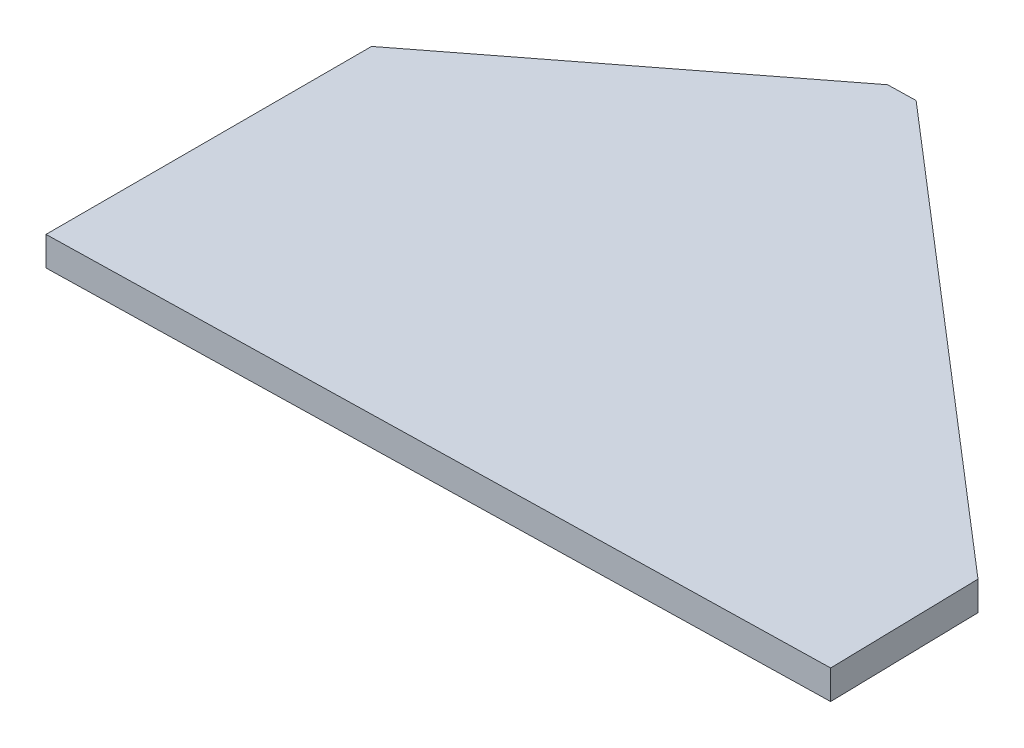
ISO-10303-21;
HEADER;
FILE_DESCRIPTION(('STEP AP214'),'2;1');
FILE_NAME('part.step','',(''),(''),'','','');
FILE_SCHEMA(('AUTOMOTIVE_DESIGN { 1 0 10303 214 1 1 1 1 }'));
ENDSEC;
DATA;
#1=APPLICATION_CONTEXT('core data for automotive mechanical design processes');
#2=APPLICATION_PROTOCOL_DEFINITION('international standard','automotive_design',2000,#1);
#3=PRODUCT_CONTEXT('',#1,'mechanical');
#4=PRODUCT('Part','Part','',(#3));
#5=PRODUCT_RELATED_PRODUCT_CATEGORY('part','',(#4));
#6=PRODUCT_DEFINITION_FORMATION('','',#4);
#7=PRODUCT_DEFINITION_CONTEXT('part definition',#1,'design');
#8=PRODUCT_DEFINITION('design','',#6,#7);
#9=PRODUCT_DEFINITION_SHAPE('','',#8);
#10=(LENGTH_UNIT() NAMED_UNIT(*) SI_UNIT(.MILLI.,.METRE.));
#11=(NAMED_UNIT(*) PLANE_ANGLE_UNIT() SI_UNIT($,.RADIAN.));
#12=(NAMED_UNIT(*) SI_UNIT($,.STERADIAN.) SOLID_ANGLE_UNIT());
#13=UNCERTAINTY_MEASURE_WITH_UNIT(LENGTH_MEASURE(1.E-05),#10,'distance_accuracy_value','');
#14=(GEOMETRIC_REPRESENTATION_CONTEXT(3) GLOBAL_UNCERTAINTY_ASSIGNED_CONTEXT((#13)) GLOBAL_UNIT_ASSIGNED_CONTEXT((#10,
#11,#12)) REPRESENTATION_CONTEXT('',''));
#15=CARTESIAN_POINT('',(0.,0.,0.));
#16=DIRECTION('',(0.,0.,1.));
#17=DIRECTION('',(1.,0.,0.));
#18=AXIS2_PLACEMENT_3D('',#15,#16,#17);
#19=CARTESIAN_POINT('',(19.9951946957844,2.,-37.7937154140761));
#20=DIRECTION('',(0.611139155400615,0.,0.791523172583231));
#21=DIRECTION('',(0.791523172583231,0.,-0.611139155400615));
#22=AXIS2_PLACEMENT_3D('',#19,#20,#21);
#23=PLANE('',#22);
#24=DIRECTION('',(-0.791523172583231,0.,0.611139155400615));
#25=VECTOR('',#24,1.);
#26=CARTESIAN_POINT('',(19.9951946957844,0.,-37.7937154140761));
#27=LINE('',#26,#25);
#28=CARTESIAN_POINT('',(19.9951946957844,0.,-37.7937154140761));
#29=VERTEX_POINT('',#28);
#30=CARTESIAN_POINT('',(0.,0.,-22.3553216667754));
#31=VERTEX_POINT('',#30);
#32=EDGE_CURVE('E128',#29,#31,#27,.T.);
#33=ORIENTED_EDGE('',*,*,#32,.T.);
#34=DIRECTION('',(0.,-1.,0.));
#35=VECTOR('',#34,1.);
#36=CARTESIAN_POINT('',(0.,2.,-22.3553216667754));
#37=LINE('',#36,#35);
#38=CARTESIAN_POINT('',(0.,2.,-22.3553216667754));
#39=VERTEX_POINT('',#38);
#40=EDGE_CURVE('E11',#39,#31,#37,.T.);
#41=ORIENTED_EDGE('',*,*,#40,.F.);
#42=DIRECTION('',(-0.791523172583231,0.,0.611139155400615));
#43=VECTOR('',#42,1.);
#44=CARTESIAN_POINT('',(19.9951946957844,2.,-37.7937154140761));
#45=LINE('',#44,#43);
#46=CARTESIAN_POINT('',(19.9951946957844,2.,-37.7937154140761));
#47=VERTEX_POINT('',#46);
#48=EDGE_CURVE('E144',#47,#39,#45,.T.);
#49=ORIENTED_EDGE('',*,*,#48,.F.);
#50=DIRECTION('',(0.,-1.,0.));
#51=VECTOR('',#50,1.);
#52=CARTESIAN_POINT('',(19.9951946957844,2.,-37.7937154140761));
#53=LINE('',#52,#51);
#54=EDGE_CURVE('E124',#47,#29,#53,.T.);
#55=ORIENTED_EDGE('',*,*,#54,.T.);
#56=EDGE_LOOP('',(#33,#41,#49,#55));
#57=FACE_BOUND('',#56,.T.);
#58=ADVANCED_FACE('F39',(#57),#23,.F.);
#59=CARTESIAN_POINT('',(0.,2.,-22.3553216667754));
#60=DIRECTION('',(1.,0.,0.));
#61=DIRECTION('',(0.,0.,-1.));
#62=AXIS2_PLACEMENT_3D('',#59,#60,#61);
#63=PLANE('',#62);
#64=DIRECTION('',(0.,0.,1.));
#65=VECTOR('',#64,1.);
#66=CARTESIAN_POINT('',(0.,0.,-22.3553216667754));
#67=LINE('',#66,#65);
#68=CARTESIAN_POINT('',(0.,0.,0.));
#69=VERTEX_POINT('',#68);
#70=EDGE_CURVE('E132',#31,#69,#67,.T.);
#71=ORIENTED_EDGE('',*,*,#70,.T.);
#72=DIRECTION('',(0.,-1.,0.));
#73=VECTOR('',#72,1.);
#74=CARTESIAN_POINT('',(0.,2.,0.));
#75=LINE('',#74,#73);
#76=CARTESIAN_POINT('',(0.,2.,0.));
#77=VERTEX_POINT('',#76);
#78=EDGE_CURVE('E48',#77,#69,#75,.T.);
#79=ORIENTED_EDGE('',*,*,#78,.F.);
#80=DIRECTION('',(0.,0.,1.));
#81=VECTOR('',#80,1.);
#82=CARTESIAN_POINT('',(0.,2.,-22.3553216667754));
#83=LINE('',#82,#81);
#84=EDGE_CURVE('E93',#39,#77,#83,.T.);
#85=ORIENTED_EDGE('',*,*,#84,.F.);
#86=ORIENTED_EDGE('',*,*,#40,.T.);
#87=EDGE_LOOP('',(#71,#79,#85,#86));
#88=FACE_BOUND('',#87,.T.);
#89=ADVANCED_FACE('F172',(#88),#63,.F.);
#90=CARTESIAN_POINT('',(0.,2.,0.));
#91=DIRECTION('',(-0.0219196873650202,0.,-0.999759734789224));
#92=DIRECTION('',(-0.999759734789224,0.,0.0219196873650202));
#93=AXIS2_PLACEMENT_3D('',#90,#91,#92);
#94=PLANE('',#93);
#95=DIRECTION('',(0.999759734789224,0.,-0.0219196873650202));
#96=VECTOR('',#95,1.);
#97=CARTESIAN_POINT('',(0.,0.,0.));
#98=LINE('',#97,#96);
#99=CARTESIAN_POINT('',(52.7262708985373,0.,-1.15602112567872));
#100=VERTEX_POINT('',#99);
#101=EDGE_CURVE('E135',#69,#100,#98,.T.);
#102=ORIENTED_EDGE('',*,*,#101,.T.);
#103=DIRECTION('',(0.,-1.,0.));
#104=VECTOR('',#103,1.);
#105=CARTESIAN_POINT('',(52.7262708985373,2.,-1.15602112567872));
#106=LINE('',#105,#104);
#107=CARTESIAN_POINT('',(52.7262708985373,2.,-1.15602112567872));
#108=VERTEX_POINT('',#107);
#109=EDGE_CURVE('E117',#108,#100,#106,.T.);
#110=ORIENTED_EDGE('',*,*,#109,.F.);
#111=DIRECTION('',(0.999759734789224,0.,-0.0219196873650202));
#112=VECTOR('',#111,1.);
#113=CARTESIAN_POINT('',(0.,2.,0.));
#114=LINE('',#113,#112);
#115=EDGE_CURVE('E106',#77,#108,#114,.T.);
#116=ORIENTED_EDGE('',*,*,#115,.F.);
#117=ORIENTED_EDGE('',*,*,#78,.T.);
#118=EDGE_LOOP('',(#102,#110,#116,#117));
#119=FACE_BOUND('',#118,.T.);
#120=ADVANCED_FACE('F154',(#119),#94,.F.);
#121=CARTESIAN_POINT('',(52.7262708985373,2.,-1.15602112567872));
#122=DIRECTION('',(-0.999759734789224,0.,0.0219196873650247));
#123=DIRECTION('',(0.0219196873650247,0.,0.999759734789224));
#124=AXIS2_PLACEMENT_3D('',#121,#122,#123);
#125=PLANE('',#124);
#126=DIRECTION('',(-0.0219196873650247,0.,-0.999759734789224));
#127=VECTOR('',#126,1.);
#128=CARTESIAN_POINT('',(52.7262708985373,0.,-1.15602112567872));
#129=LINE('',#128,#127);
#130=CARTESIAN_POINT('',(52.4994822182698,0.,-11.4998817411023));
#131=VERTEX_POINT('',#130);
#132=EDGE_CURVE('E115',#100,#131,#129,.T.);
#133=ORIENTED_EDGE('',*,*,#132,.T.);
#134=DIRECTION('',(0.,-1.,0.));
#135=VECTOR('',#134,1.);
#136=CARTESIAN_POINT('',(52.4994822182698,2.,-11.4998817411023));
#137=LINE('',#136,#135);
#138=CARTESIAN_POINT('',(52.4994822182698,2.,-11.4998817411023));
#139=VERTEX_POINT('',#138);
#140=EDGE_CURVE('E112',#139,#131,#137,.T.);
#141=ORIENTED_EDGE('',*,*,#140,.F.);
#142=DIRECTION('',(-0.0219196873650247,0.,-0.999759734789224));
#143=VECTOR('',#142,1.);
#144=CARTESIAN_POINT('',(52.7262708985373,2.,-1.15602112567872));
#145=LINE('',#144,#143);
#146=EDGE_CURVE('E100',#108,#139,#145,.T.);
#147=ORIENTED_EDGE('',*,*,#146,.F.);
#148=ORIENTED_EDGE('',*,*,#109,.T.);
#149=EDGE_LOOP('',(#133,#141,#147,#148));
#150=FACE_BOUND('',#149,.T.);
#151=ADVANCED_FACE('F113',(#150),#125,.F.);
#152=CARTESIAN_POINT('',(52.4994822182698,2.,-11.4998817411023));
#153=DIRECTION('',(-0.652511227364217,0.,0.757779056297839));
#154=DIRECTION('',(0.757779056297839,0.,0.652511227364217));
#155=AXIS2_PLACEMENT_3D('',#152,#153,#154);
#156=PLANE('',#155);
#157=DIRECTION('',(-0.757779056297839,0.,-0.652511227364217));
#158=VECTOR('',#157,1.);
#159=CARTESIAN_POINT('',(52.4994822182698,0.,-11.4998817411023));
#160=LINE('',#159,#158);
#161=CARTESIAN_POINT('',(21.9148586157376,0.,-37.8358039594606));
#162=VERTEX_POINT('',#161);
#163=EDGE_CURVE('E79',#131,#162,#160,.T.);
#164=ORIENTED_EDGE('',*,*,#163,.T.);
#165=DIRECTION('',(0.,-1.,0.));
#166=VECTOR('',#165,1.);
#167=CARTESIAN_POINT('',(21.9148586157376,2.,-37.8358039594606));
#168=LINE('',#167,#166);
#169=CARTESIAN_POINT('',(21.9148586157376,2.,-37.8358039594606));
#170=VERTEX_POINT('',#169);
#171=EDGE_CURVE('E118',#170,#162,#168,.T.);
#172=ORIENTED_EDGE('',*,*,#171,.F.);
#173=DIRECTION('',(-0.757779056297839,0.,-0.652511227364217));
#174=VECTOR('',#173,1.);
#175=CARTESIAN_POINT('',(52.4994822182698,2.,-11.4998817411023));
#176=LINE('',#175,#174);
#177=EDGE_CURVE('E104',#139,#170,#176,.T.);
#178=ORIENTED_EDGE('',*,*,#177,.F.);
#179=ORIENTED_EDGE('',*,*,#140,.T.);
#180=EDGE_LOOP('',(#164,#172,#178,#179));
#181=FACE_BOUND('',#180,.T.);
#182=ADVANCED_FACE('F120',(#181),#156,.F.);
#183=CARTESIAN_POINT('',(21.9148586157376,2.,-37.8358039594606));
#184=DIRECTION('',(0.0219196873650057,0.,0.999759734789225));
#185=DIRECTION('',(0.999759734789225,0.,-0.0219196873650057));
#186=AXIS2_PLACEMENT_3D('',#183,#184,#185);
#187=PLANE('',#186);
#188=DIRECTION('',(-0.999759734789225,0.,0.0219196873650057));
#189=VECTOR('',#188,1.);
#190=CARTESIAN_POINT('',(21.9148586157376,0.,-37.8358039594606));
#191=LINE('',#190,#189);
#192=EDGE_CURVE('E85',#162,#29,#191,.T.);
#193=ORIENTED_EDGE('',*,*,#192,.T.);
#194=ORIENTED_EDGE('',*,*,#54,.F.);
#195=DIRECTION('',(-0.999759734789225,0.,0.0219196873650057));
#196=VECTOR('',#195,1.);
#197=CARTESIAN_POINT('',(21.9148586157376,2.,-37.8358039594606));
#198=LINE('',#197,#196);
#199=EDGE_CURVE('E56',#170,#47,#198,.T.);
#200=ORIENTED_EDGE('',*,*,#199,.F.);
#201=ORIENTED_EDGE('',*,*,#171,.T.);
#202=EDGE_LOOP('',(#193,#194,#200,#201));
#203=FACE_BOUND('',#202,.T.);
#204=ADVANCED_FACE('F161',(#203),#187,.F.);
#205=CARTESIAN_POINT('',(0.,2.,0.));
#206=DIRECTION('',(0.,-1.,0.));
#207=DIRECTION('',(0.,0.,-1.));
#208=AXIS2_PLACEMENT_3D('',#205,#206,#207);
#209=PLANE('',#208);
#210=ORIENTED_EDGE('',*,*,#48,.T.);
#211=ORIENTED_EDGE('',*,*,#84,.T.);
#212=ORIENTED_EDGE('',*,*,#115,.T.);
#213=ORIENTED_EDGE('',*,*,#146,.T.);
#214=ORIENTED_EDGE('',*,*,#177,.T.);
#215=ORIENTED_EDGE('',*,*,#199,.T.);
#216=EDGE_LOOP('',(#210,#211,#212,#213,#214,#215));
#217=FACE_BOUND('',#216,.T.);
#218=ADVANCED_FACE('F102',(#217),#209,.F.);
#219=CARTESIAN_POINT('',(0.,0.,0.));
#220=DIRECTION('',(0.,-1.,0.));
#221=DIRECTION('',(0.,0.,-1.));
#222=AXIS2_PLACEMENT_3D('',#219,#220,#221);
#223=PLANE('',#222);
#224=ORIENTED_EDGE('',*,*,#32,.F.);
#225=ORIENTED_EDGE('',*,*,#192,.F.);
#226=ORIENTED_EDGE('',*,*,#163,.F.);
#227=ORIENTED_EDGE('',*,*,#132,.F.);
#228=ORIENTED_EDGE('',*,*,#101,.F.);
#229=ORIENTED_EDGE('',*,*,#70,.F.);
#230=EDGE_LOOP('',(#224,#225,#226,#227,#228,#229));
#231=FACE_BOUND('',#230,.T.);
#232=ADVANCED_FACE('F157',(#231),#223,.T.);
#233=CLOSED_SHELL('',(#58,#89,#120,#151,#182,#204,#218,#232));
#234=MANIFOLD_SOLID_BREP('B2',#233);
#235=ADVANCED_BREP_SHAPE_REPRESENTATION('',(#18,#234),#14);
#236=SHAPE_DEFINITION_REPRESENTATION(#9,#235);
ENDSEC;
END-ISO-10303-21;
